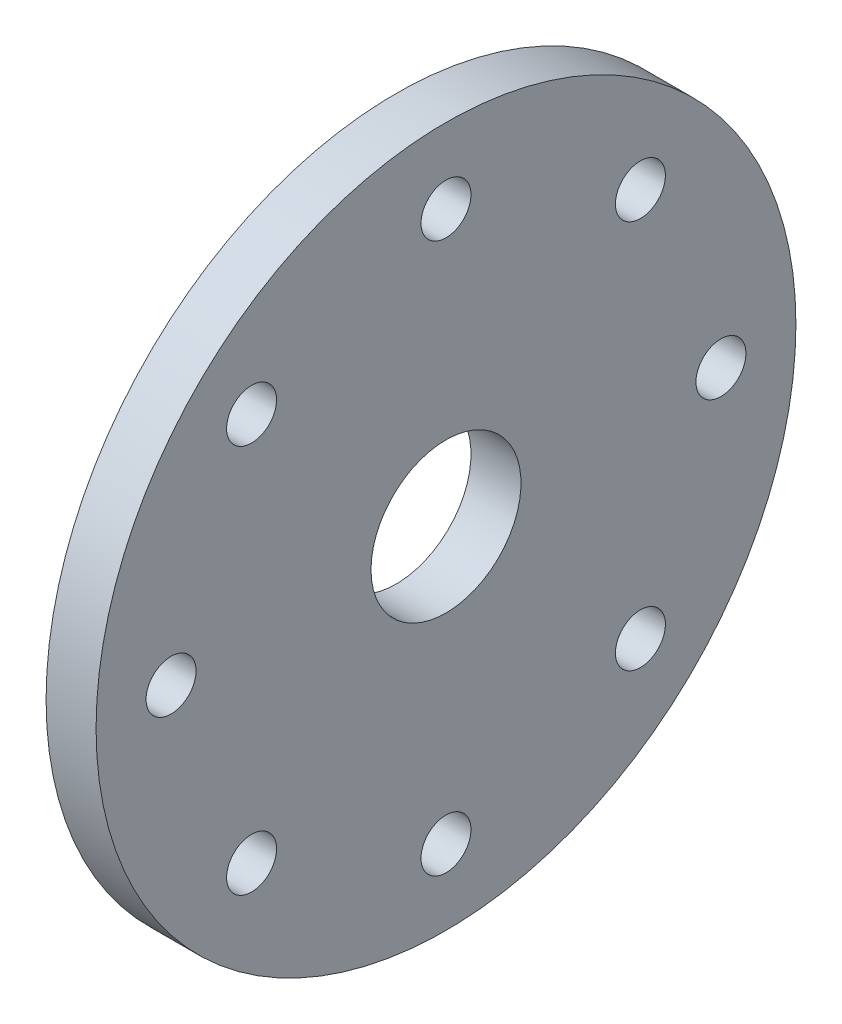
ISO-10303-21;
HEADER;
FILE_DESCRIPTION(('STEP AP214'),'2;1');
FILE_NAME('part.step','',(''),(''),'','','');
FILE_SCHEMA(('AUTOMOTIVE_DESIGN { 1 0 10303 214 1 1 1 1 }'));
ENDSEC;
DATA;
#1=APPLICATION_CONTEXT('core data for automotive mechanical design processes');
#2=APPLICATION_PROTOCOL_DEFINITION('international standard','automotive_design',2000,#1);
#3=PRODUCT_CONTEXT('',#1,'mechanical');
#4=PRODUCT('Part','Part','',(#3));
#5=PRODUCT_RELATED_PRODUCT_CATEGORY('part','',(#4));
#6=PRODUCT_DEFINITION_FORMATION('','',#4);
#7=PRODUCT_DEFINITION_CONTEXT('part definition',#1,'design');
#8=PRODUCT_DEFINITION('design','',#6,#7);
#9=PRODUCT_DEFINITION_SHAPE('','',#8);
#10=(LENGTH_UNIT() NAMED_UNIT(*) SI_UNIT(.MILLI.,.METRE.));
#11=(NAMED_UNIT(*) PLANE_ANGLE_UNIT() SI_UNIT($,.RADIAN.));
#12=(NAMED_UNIT(*) SI_UNIT($,.STERADIAN.) SOLID_ANGLE_UNIT());
#13=UNCERTAINTY_MEASURE_WITH_UNIT(LENGTH_MEASURE(1.E-05),#10,'distance_accuracy_value','');
#14=(GEOMETRIC_REPRESENTATION_CONTEXT(3) GLOBAL_UNCERTAINTY_ASSIGNED_CONTEXT((#13)) GLOBAL_UNIT_ASSIGNED_CONTEXT((#10,
#11,#12)) REPRESENTATION_CONTEXT('',''));
#15=CARTESIAN_POINT('',(0.,0.,0.));
#16=DIRECTION('',(0.,0.,1.));
#17=DIRECTION('',(1.,0.,0.));
#18=AXIS2_PLACEMENT_3D('',#15,#16,#17);
#19=CARTESIAN_POINT('',(-2.,3.,0.));
#20=DIRECTION('',(1.,0.,0.));
#21=DIRECTION('',(0.,0.,-1.));
#22=AXIS2_PLACEMENT_3D('',#19,#20,#21);
#23=PLANE('',#22);
#24=CARTESIAN_POINT('',(-2.,7.77817459305212,7.77817459305193));
#25=DIRECTION('',(1.,0.,0.));
#26=DIRECTION('',(0.,0.707106781186539,-0.707106781186556));
#27=AXIS2_PLACEMENT_3D('',#24,#25,#26);
#28=CIRCLE('',#27,1.);
#29=CARTESIAN_POINT('',(-2.,8.48528137423866,7.07106781186537));
#30=VERTEX_POINT('',#29);
#31=EDGE_CURVE('E73',#30,#30,#28,.T.);
#32=ORIENTED_EDGE('',*,*,#31,.T.);
#33=EDGE_LOOP('',(#32));
#34=FACE_BOUND('',#33,.T.);
#35=CARTESIAN_POINT('',(-2.,1.15218884181823E-13,11.));
#36=DIRECTION('',(1.,0.,0.));
#37=DIRECTION('',(0.,1.,0.));
#38=AXIS2_PLACEMENT_3D('',#35,#36,#37);
#39=CIRCLE('',#38,1.);
#40=CARTESIAN_POINT('',(-2.,1.00000000000012,11.));
#41=VERTEX_POINT('',#40);
#42=EDGE_CURVE('E67',#41,#41,#39,.T.);
#43=ORIENTED_EDGE('',*,*,#42,.T.);
#44=EDGE_LOOP('',(#43));
#45=FACE_BOUND('',#44,.T.);
#46=CARTESIAN_POINT('',(-2.,-7.77817459305195,7.77817459305209));
#47=DIRECTION('',(1.,0.,0.));
#48=DIRECTION('',(0.,0.707106781186554,0.707106781186541));
#49=AXIS2_PLACEMENT_3D('',#46,#47,#48);
#50=CIRCLE('',#49,1.);
#51=CARTESIAN_POINT('',(-2.,-7.0710678118654,8.48528137423863));
#52=VERTEX_POINT('',#51);
#53=EDGE_CURVE('E61',#52,#52,#50,.T.);
#54=ORIENTED_EDGE('',*,*,#53,.T.);
#55=EDGE_LOOP('',(#54));
#56=FACE_BOUND('',#55,.T.);
#57=CARTESIAN_POINT('',(-2.,-11.,0.));
#58=DIRECTION('',(1.,0.,0.));
#59=DIRECTION('',(0.,0.,1.));
#60=AXIS2_PLACEMENT_3D('',#57,#58,#59);
#61=CIRCLE('',#60,1.);
#62=CARTESIAN_POINT('',(-2.,-11.,1.));
#63=VERTEX_POINT('',#62);
#64=EDGE_CURVE('E55',#63,#63,#61,.T.);
#65=ORIENTED_EDGE('',*,*,#64,.T.);
#66=EDGE_LOOP('',(#65));
#67=FACE_BOUND('',#66,.T.);
#68=CARTESIAN_POINT('',(-2.,-7.77817459305206,-7.77817459305198));
#69=DIRECTION('',(1.,0.,0.));
#70=DIRECTION('',(0.,-0.707106781186544,0.707106781186551));
#71=AXIS2_PLACEMENT_3D('',#68,#69,#70);
#72=CIRCLE('',#71,1.);
#73=CARTESIAN_POINT('',(-2.,-8.48528137423861,-7.07106781186543));
#74=VERTEX_POINT('',#73);
#75=EDGE_CURVE('E49',#74,#74,#72,.T.);
#76=ORIENTED_EDGE('',*,*,#75,.T.);
#77=EDGE_LOOP('',(#76));
#78=FACE_BOUND('',#77,.T.);
#79=CARTESIAN_POINT('',(-2.,0.,-11.));
#80=DIRECTION('',(1.,0.,0.));
#81=DIRECTION('',(0.,-1.,0.));
#82=AXIS2_PLACEMENT_3D('',#79,#80,#81);
#83=CIRCLE('',#82,1.);
#84=CARTESIAN_POINT('',(-2.,-1.00000000000004,-11.));
#85=VERTEX_POINT('',#84);
#86=EDGE_CURVE('E43',#85,#85,#83,.T.);
#87=ORIENTED_EDGE('',*,*,#86,.T.);
#88=EDGE_LOOP('',(#87));
#89=FACE_BOUND('',#88,.T.);
#90=CARTESIAN_POINT('',(-2.,7.77817459305201,-7.77817459305204));
#91=DIRECTION('',(1.,0.,0.));
#92=DIRECTION('',(0.,-0.707106781186549,-0.707106781186546));
#93=AXIS2_PLACEMENT_3D('',#90,#91,#92);
#94=CIRCLE('',#93,1.);
#95=CARTESIAN_POINT('',(-2.,7.07106781186546,-8.48528137423859));
#96=VERTEX_POINT('',#95);
#97=EDGE_CURVE('E37',#96,#96,#94,.T.);
#98=ORIENTED_EDGE('',*,*,#97,.T.);
#99=EDGE_LOOP('',(#98));
#100=FACE_BOUND('',#99,.T.);
#101=CARTESIAN_POINT('',(-2.,11.,0.));
#102=DIRECTION('',(1.,0.,0.));
#103=DIRECTION('',(0.,0.,-1.));
#104=AXIS2_PLACEMENT_3D('',#101,#102,#103);
#105=CIRCLE('',#104,1.);
#106=CARTESIAN_POINT('',(-2.,11.,-1.));
#107=VERTEX_POINT('',#106);
#108=EDGE_CURVE('E33',#107,#107,#105,.T.);
#109=ORIENTED_EDGE('',*,*,#108,.T.);
#110=EDGE_LOOP('',(#109));
#111=FACE_BOUND('',#110,.T.);
#112=CARTESIAN_POINT('',(-2.,0.,0.));
#113=DIRECTION('',(-1.,0.,0.));
#114=DIRECTION('',(0.,0.,1.));
#115=AXIS2_PLACEMENT_3D('',#112,#113,#114);
#116=CIRCLE('',#115,3.);
#117=CARTESIAN_POINT('',(-2.,0.,3.));
#118=VERTEX_POINT('',#117);
#119=EDGE_CURVE('E28',#118,#118,#116,.T.);
#120=ORIENTED_EDGE('',*,*,#119,.F.);
#121=EDGE_LOOP('',(#120));
#122=FACE_BOUND('',#121,.T.);
#123=CARTESIAN_POINT('',(-2.,0.,0.));
#124=DIRECTION('',(-1.,0.,0.));
#125=DIRECTION('',(0.,0.,1.));
#126=AXIS2_PLACEMENT_3D('',#123,#124,#125);
#127=CIRCLE('',#126,14.);
#128=CARTESIAN_POINT('',(-2.,0.,14.));
#129=VERTEX_POINT('',#128);
#130=EDGE_CURVE('E9',#129,#129,#127,.T.);
#131=ORIENTED_EDGE('',*,*,#130,.T.);
#132=EDGE_LOOP('',(#131));
#133=FACE_BOUND('',#132,.T.);
#134=ADVANCED_FACE('F14',(#34,#45,#56,#67,#78,#89,#100,#111,#122,#133),#23,.F.);
#135=CARTESIAN_POINT('',(0.,0.,0.));
#136=DIRECTION('',(-1.,0.,0.));
#137=DIRECTION('',(0.,0.,1.));
#138=AXIS2_PLACEMENT_3D('',#135,#136,#137);
#139=CYLINDRICAL_SURFACE('',#138,14.);
#140=ORIENTED_EDGE('',*,*,#130,.F.);
#141=EDGE_LOOP('',(#140));
#142=FACE_BOUND('',#141,.T.);
#143=CARTESIAN_POINT('',(0.,0.,0.));
#144=DIRECTION('',(-1.,0.,0.));
#145=DIRECTION('',(0.,0.,1.));
#146=AXIS2_PLACEMENT_3D('',#143,#144,#145);
#147=CIRCLE('',#146,14.);
#148=CARTESIAN_POINT('',(0.,0.,14.));
#149=VERTEX_POINT('',#148);
#150=EDGE_CURVE('E20',#149,#149,#147,.T.);
#151=ORIENTED_EDGE('',*,*,#150,.T.);
#152=EDGE_LOOP('',(#151));
#153=FACE_BOUND('',#152,.T.);
#154=ADVANCED_FACE('F95',(#142,#153),#139,.T.);
#155=CARTESIAN_POINT('',(0.,14.,0.));
#156=DIRECTION('',(-1.,0.,0.));
#157=DIRECTION('',(0.,0.,1.));
#158=AXIS2_PLACEMENT_3D('',#155,#156,#157);
#159=PLANE('',#158);
#160=CARTESIAN_POINT('',(0.,7.77817459305212,7.77817459305193));
#161=DIRECTION('',(1.,0.,0.));
#162=DIRECTION('',(0.,0.707106781186539,-0.707106781186556));
#163=AXIS2_PLACEMENT_3D('',#160,#161,#162);
#164=CIRCLE('',#163,1.);
#165=CARTESIAN_POINT('',(0.,8.48528137423866,7.07106781186537));
#166=VERTEX_POINT('',#165);
#167=EDGE_CURVE('E76',#166,#166,#164,.T.);
#168=ORIENTED_EDGE('',*,*,#167,.F.);
#169=EDGE_LOOP('',(#168));
#170=FACE_BOUND('',#169,.T.);
#171=CARTESIAN_POINT('',(0.,1.15218884181823E-13,11.));
#172=DIRECTION('',(1.,0.,0.));
#173=DIRECTION('',(0.,1.,0.));
#174=AXIS2_PLACEMENT_3D('',#171,#172,#173);
#175=CIRCLE('',#174,1.);
#176=CARTESIAN_POINT('',(0.,1.00000000000012,11.));
#177=VERTEX_POINT('',#176);
#178=EDGE_CURVE('E70',#177,#177,#175,.T.);
#179=ORIENTED_EDGE('',*,*,#178,.F.);
#180=EDGE_LOOP('',(#179));
#181=FACE_BOUND('',#180,.T.);
#182=CARTESIAN_POINT('',(0.,-7.77817459305195,7.77817459305209));
#183=DIRECTION('',(1.,0.,0.));
#184=DIRECTION('',(0.,0.707106781186554,0.707106781186541));
#185=AXIS2_PLACEMENT_3D('',#182,#183,#184);
#186=CIRCLE('',#185,1.);
#187=CARTESIAN_POINT('',(0.,-7.0710678118654,8.48528137423863));
#188=VERTEX_POINT('',#187);
#189=EDGE_CURVE('E64',#188,#188,#186,.T.);
#190=ORIENTED_EDGE('',*,*,#189,.F.);
#191=EDGE_LOOP('',(#190));
#192=FACE_BOUND('',#191,.T.);
#193=CARTESIAN_POINT('',(0.,-11.,0.));
#194=DIRECTION('',(1.,0.,0.));
#195=DIRECTION('',(0.,0.,1.));
#196=AXIS2_PLACEMENT_3D('',#193,#194,#195);
#197=CIRCLE('',#196,1.);
#198=CARTESIAN_POINT('',(0.,-11.,1.));
#199=VERTEX_POINT('',#198);
#200=EDGE_CURVE('E58',#199,#199,#197,.T.);
#201=ORIENTED_EDGE('',*,*,#200,.F.);
#202=EDGE_LOOP('',(#201));
#203=FACE_BOUND('',#202,.T.);
#204=CARTESIAN_POINT('',(0.,-7.77817459305206,-7.77817459305198));
#205=DIRECTION('',(1.,0.,0.));
#206=DIRECTION('',(0.,-0.707106781186544,0.707106781186551));
#207=AXIS2_PLACEMENT_3D('',#204,#205,#206);
#208=CIRCLE('',#207,1.);
#209=CARTESIAN_POINT('',(0.,-8.48528137423861,-7.07106781186543));
#210=VERTEX_POINT('',#209);
#211=EDGE_CURVE('E52',#210,#210,#208,.T.);
#212=ORIENTED_EDGE('',*,*,#211,.F.);
#213=EDGE_LOOP('',(#212));
#214=FACE_BOUND('',#213,.T.);
#215=CARTESIAN_POINT('',(0.,0.,-11.));
#216=DIRECTION('',(1.,0.,0.));
#217=DIRECTION('',(0.,-1.,0.));
#218=AXIS2_PLACEMENT_3D('',#215,#216,#217);
#219=CIRCLE('',#218,1.);
#220=CARTESIAN_POINT('',(0.,-1.00000000000004,-11.));
#221=VERTEX_POINT('',#220);
#222=EDGE_CURVE('E46',#221,#221,#219,.T.);
#223=ORIENTED_EDGE('',*,*,#222,.F.);
#224=EDGE_LOOP('',(#223));
#225=FACE_BOUND('',#224,.T.);
#226=CARTESIAN_POINT('',(0.,7.77817459305201,-7.77817459305204));
#227=DIRECTION('',(1.,0.,0.));
#228=DIRECTION('',(0.,-0.707106781186549,-0.707106781186546));
#229=AXIS2_PLACEMENT_3D('',#226,#227,#228);
#230=CIRCLE('',#229,1.);
#231=CARTESIAN_POINT('',(0.,7.07106781186546,-8.48528137423859));
#232=VERTEX_POINT('',#231);
#233=EDGE_CURVE('E40',#232,#232,#230,.T.);
#234=ORIENTED_EDGE('',*,*,#233,.F.);
#235=EDGE_LOOP('',(#234));
#236=FACE_BOUND('',#235,.T.);
#237=CARTESIAN_POINT('',(0.,11.,0.));
#238=DIRECTION('',(1.,0.,0.));
#239=DIRECTION('',(0.,0.,-1.));
#240=AXIS2_PLACEMENT_3D('',#237,#238,#239);
#241=CIRCLE('',#240,1.);
#242=CARTESIAN_POINT('',(0.,11.,-1.));
#243=VERTEX_POINT('',#242);
#244=EDGE_CURVE('E34',#243,#243,#241,.T.);
#245=ORIENTED_EDGE('',*,*,#244,.F.);
#246=EDGE_LOOP('',(#245));
#247=FACE_BOUND('',#246,.T.);
#248=ORIENTED_EDGE('',*,*,#150,.F.);
#249=EDGE_LOOP('',(#248));
#250=FACE_BOUND('',#249,.T.);
#251=CARTESIAN_POINT('',(0.,0.,0.));
#252=DIRECTION('',(-1.,0.,0.));
#253=DIRECTION('',(0.,0.,1.));
#254=AXIS2_PLACEMENT_3D('',#251,#252,#253);
#255=CIRCLE('',#254,3.);
#256=CARTESIAN_POINT('',(0.,0.,3.));
#257=VERTEX_POINT('',#256);
#258=EDGE_CURVE('E24',#257,#257,#255,.T.);
#259=ORIENTED_EDGE('',*,*,#258,.T.);
#260=EDGE_LOOP('',(#259));
#261=FACE_BOUND('',#260,.T.);
#262=ADVANCED_FACE('F91',(#170,#181,#192,#203,#214,#225,#236,#247,#250,#261),#159,.F.);
#263=CARTESIAN_POINT('',(0.,0.,0.));
#264=DIRECTION('',(-1.,0.,0.));
#265=DIRECTION('',(0.,0.,1.));
#266=AXIS2_PLACEMENT_3D('',#263,#264,#265);
#267=CYLINDRICAL_SURFACE('',#266,3.);
#268=ORIENTED_EDGE('',*,*,#258,.F.);
#269=EDGE_LOOP('',(#268));
#270=FACE_BOUND('',#269,.T.);
#271=ORIENTED_EDGE('',*,*,#119,.T.);
#272=EDGE_LOOP('',(#271));
#273=FACE_BOUND('',#272,.T.);
#274=ADVANCED_FACE('F94',(#270,#273),#267,.F.);
#275=CARTESIAN_POINT('',(-2.,11.,0.));
#276=DIRECTION('',(1.,0.,0.));
#277=DIRECTION('',(0.,0.,-1.));
#278=AXIS2_PLACEMENT_3D('',#275,#276,#277);
#279=CYLINDRICAL_SURFACE('',#278,1.);
#280=ORIENTED_EDGE('',*,*,#108,.F.);
#281=EDGE_LOOP('',(#280));
#282=FACE_BOUND('',#281,.T.);
#283=ORIENTED_EDGE('',*,*,#244,.T.);
#284=EDGE_LOOP('',(#283));
#285=FACE_BOUND('',#284,.T.);
#286=ADVANCED_FACE('F116',(#282,#285),#279,.F.);
#287=CARTESIAN_POINT('',(-2.,7.77817459305201,-7.77817459305204));
#288=DIRECTION('',(1.,0.,0.));
#289=DIRECTION('',(0.,0.,-1.));
#290=AXIS2_PLACEMENT_3D('',#287,#288,#289);
#291=CYLINDRICAL_SURFACE('',#290,1.);
#292=ORIENTED_EDGE('',*,*,#97,.F.);
#293=EDGE_LOOP('',(#292));
#294=FACE_BOUND('',#293,.T.);
#295=ORIENTED_EDGE('',*,*,#233,.T.);
#296=EDGE_LOOP('',(#295));
#297=FACE_BOUND('',#296,.T.);
#298=ADVANCED_FACE('F133',(#294,#297),#291,.F.);
#299=CARTESIAN_POINT('',(-2.,0.,-11.));
#300=DIRECTION('',(1.,0.,0.));
#301=DIRECTION('',(0.,0.,-1.));
#302=AXIS2_PLACEMENT_3D('',#299,#300,#301);
#303=CYLINDRICAL_SURFACE('',#302,1.);
#304=ORIENTED_EDGE('',*,*,#86,.F.);
#305=EDGE_LOOP('',(#304));
#306=FACE_BOUND('',#305,.T.);
#307=ORIENTED_EDGE('',*,*,#222,.T.);
#308=EDGE_LOOP('',(#307));
#309=FACE_BOUND('',#308,.T.);
#310=ADVANCED_FACE('F137',(#306,#309),#303,.F.);
#311=CARTESIAN_POINT('',(-2.,-7.77817459305206,-7.77817459305198));
#312=DIRECTION('',(1.,0.,0.));
#313=DIRECTION('',(0.,0.,-1.));
#314=AXIS2_PLACEMENT_3D('',#311,#312,#313);
#315=CYLINDRICAL_SURFACE('',#314,1.);
#316=ORIENTED_EDGE('',*,*,#75,.F.);
#317=EDGE_LOOP('',(#316));
#318=FACE_BOUND('',#317,.T.);
#319=ORIENTED_EDGE('',*,*,#211,.T.);
#320=EDGE_LOOP('',(#319));
#321=FACE_BOUND('',#320,.T.);
#322=ADVANCED_FACE('F141',(#318,#321),#315,.F.);
#323=CARTESIAN_POINT('',(-2.,-11.,0.));
#324=DIRECTION('',(1.,0.,0.));
#325=DIRECTION('',(0.,0.,-1.));
#326=AXIS2_PLACEMENT_3D('',#323,#324,#325);
#327=CYLINDRICAL_SURFACE('',#326,1.);
#328=ORIENTED_EDGE('',*,*,#64,.F.);
#329=EDGE_LOOP('',(#328));
#330=FACE_BOUND('',#329,.T.);
#331=ORIENTED_EDGE('',*,*,#200,.T.);
#332=EDGE_LOOP('',(#331));
#333=FACE_BOUND('',#332,.T.);
#334=ADVANCED_FACE('F145',(#330,#333),#327,.F.);
#335=CARTESIAN_POINT('',(-2.,-7.77817459305195,7.77817459305209));
#336=DIRECTION('',(1.,0.,0.));
#337=DIRECTION('',(0.,0.,-1.));
#338=AXIS2_PLACEMENT_3D('',#335,#336,#337);
#339=CYLINDRICAL_SURFACE('',#338,1.);
#340=ORIENTED_EDGE('',*,*,#53,.F.);
#341=EDGE_LOOP('',(#340));
#342=FACE_BOUND('',#341,.T.);
#343=ORIENTED_EDGE('',*,*,#189,.T.);
#344=EDGE_LOOP('',(#343));
#345=FACE_BOUND('',#344,.T.);
#346=ADVANCED_FACE('F149',(#342,#345),#339,.F.);
#347=CARTESIAN_POINT('',(-2.,1.15218884181823E-13,11.));
#348=DIRECTION('',(1.,0.,0.));
#349=DIRECTION('',(0.,0.,-1.));
#350=AXIS2_PLACEMENT_3D('',#347,#348,#349);
#351=CYLINDRICAL_SURFACE('',#350,1.);
#352=ORIENTED_EDGE('',*,*,#42,.F.);
#353=EDGE_LOOP('',(#352));
#354=FACE_BOUND('',#353,.T.);
#355=ORIENTED_EDGE('',*,*,#178,.T.);
#356=EDGE_LOOP('',(#355));
#357=FACE_BOUND('',#356,.T.);
#358=ADVANCED_FACE('F87',(#354,#357),#351,.F.);
#359=CARTESIAN_POINT('',(-2.,7.77817459305212,7.77817459305193));
#360=DIRECTION('',(1.,0.,0.));
#361=DIRECTION('',(0.,0.,-1.));
#362=AXIS2_PLACEMENT_3D('',#359,#360,#361);
#363=CYLINDRICAL_SURFACE('',#362,1.);
#364=ORIENTED_EDGE('',*,*,#31,.F.);
#365=EDGE_LOOP('',(#364));
#366=FACE_BOUND('',#365,.T.);
#367=ORIENTED_EDGE('',*,*,#167,.T.);
#368=EDGE_LOOP('',(#367));
#369=FACE_BOUND('',#368,.T.);
#370=ADVANCED_FACE('F84',(#366,#369),#363,.F.);
#371=CLOSED_SHELL('',(#134,#154,#262,#274,#286,#298,#310,#322,#334,#346,#358,#370));
#372=MANIFOLD_SOLID_BREP('B1',#371);
#373=ADVANCED_BREP_SHAPE_REPRESENTATION('',(#18,#372),#14);
#374=SHAPE_DEFINITION_REPRESENTATION(#9,#373);
ENDSEC;
END-ISO-10303-21;
